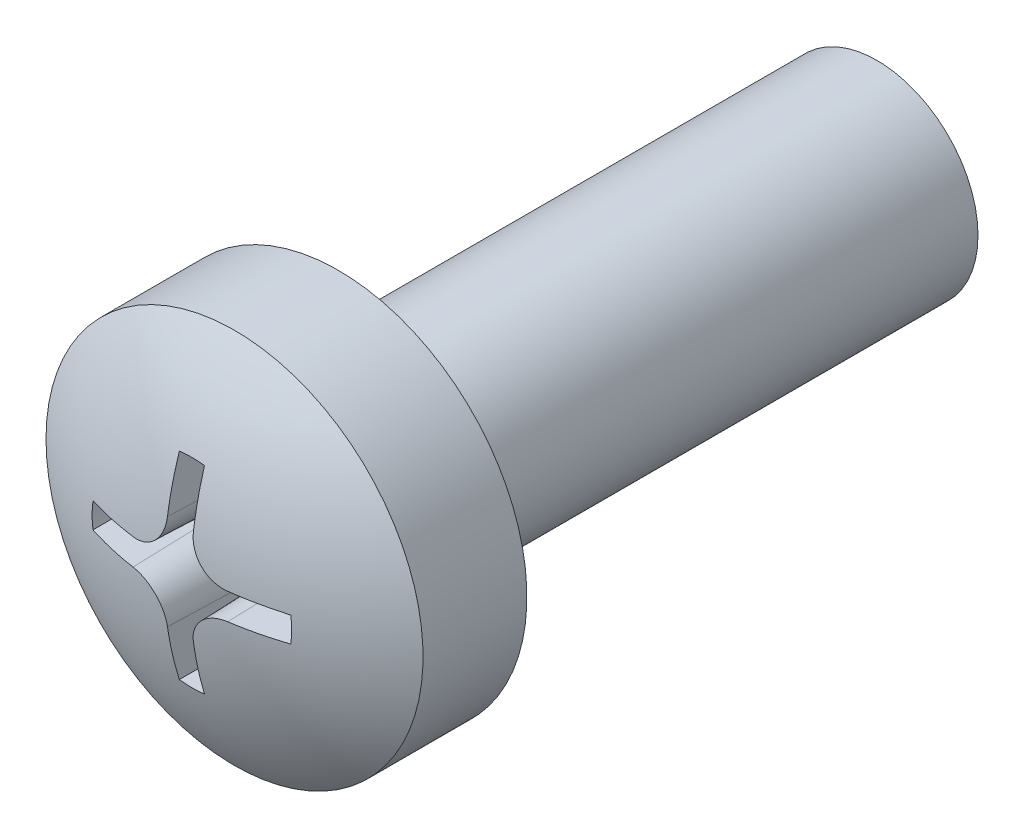
ISO-10303-21;
HEADER;
FILE_DESCRIPTION(('STEP AP214'),'2;1');
FILE_NAME('part.step','',(''),(''),'','','');
FILE_SCHEMA(('AUTOMOTIVE_DESIGN { 1 0 10303 214 1 1 1 1 }'));
ENDSEC;
DATA;
#1=APPLICATION_CONTEXT('core data for automotive mechanical design processes');
#2=APPLICATION_PROTOCOL_DEFINITION('international standard','automotive_design',2000,#1);
#3=PRODUCT_CONTEXT('',#1,'mechanical');
#4=PRODUCT('Part','Part','',(#3));
#5=PRODUCT_RELATED_PRODUCT_CATEGORY('part','',(#4));
#6=PRODUCT_DEFINITION_FORMATION('','',#4);
#7=PRODUCT_DEFINITION_CONTEXT('part definition',#1,'design');
#8=PRODUCT_DEFINITION('design','',#6,#7);
#9=PRODUCT_DEFINITION_SHAPE('','',#8);
#10=(LENGTH_UNIT() NAMED_UNIT(*) SI_UNIT(.MILLI.,.METRE.));
#11=(NAMED_UNIT(*) PLANE_ANGLE_UNIT() SI_UNIT($,.RADIAN.));
#12=(NAMED_UNIT(*) SI_UNIT($,.STERADIAN.) SOLID_ANGLE_UNIT());
#13=UNCERTAINTY_MEASURE_WITH_UNIT(LENGTH_MEASURE(1.E-05),#10,'distance_accuracy_value','');
#14=(GEOMETRIC_REPRESENTATION_CONTEXT(3) GLOBAL_UNCERTAINTY_ASSIGNED_CONTEXT((#13)) GLOBAL_UNIT_ASSIGNED_CONTEXT((#10,
#11,#12)) REPRESENTATION_CONTEXT('',''));
#15=CARTESIAN_POINT('',(0.,0.,0.));
#16=DIRECTION('',(0.,0.,1.));
#17=DIRECTION('',(1.,0.,0.));
#18=AXIS2_PLACEMENT_3D('',#15,#16,#17);
#19=CARTESIAN_POINT('',(0.,0.,8.));
#20=DIRECTION('',(0.,0.,-1.));
#21=DIRECTION('',(-1.,0.,0.));
#22=AXIS2_PLACEMENT_3D('',#19,#20,#21);
#23=CYLINDRICAL_SURFACE('',#22,1.5);
#24=CARTESIAN_POINT('',(0.,0.,8.));
#25=DIRECTION('',(0.,0.,1.));
#26=DIRECTION('',(1.,0.,0.));
#27=AXIS2_PLACEMENT_3D('',#24,#25,#26);
#28=CIRCLE('',#27,1.5);
#29=CARTESIAN_POINT('',(1.5,0.,8.));
#30=VERTEX_POINT('',#29);
#31=EDGE_CURVE('E206',#30,#30,#28,.T.);
#32=ORIENTED_EDGE('',*,*,#31,.F.);
#33=EDGE_LOOP('',(#32));
#34=FACE_BOUND('',#33,.T.);
#35=CARTESIAN_POINT('',(0.,0.,0.));
#36=DIRECTION('',(0.,0.,1.));
#37=DIRECTION('',(1.,0.,0.));
#38=AXIS2_PLACEMENT_3D('',#35,#36,#37);
#39=CIRCLE('',#38,1.5);
#40=CARTESIAN_POINT('',(1.5,0.,0.));
#41=VERTEX_POINT('',#40);
#42=EDGE_CURVE('E205',#41,#41,#39,.T.);
#43=ORIENTED_EDGE('',*,*,#42,.T.);
#44=EDGE_LOOP('',(#43));
#45=FACE_BOUND('',#44,.T.);
#46=ADVANCED_FACE('F34',(#34,#45),#23,.T.);
#47=CARTESIAN_POINT('',(0.,0.,0.));
#48=DIRECTION('',(0.,0.,1.));
#49=DIRECTION('',(1.,0.,0.));
#50=AXIS2_PLACEMENT_3D('',#47,#48,#49);
#51=PLANE('',#50);
#52=ORIENTED_EDGE('',*,*,#42,.F.);
#53=EDGE_LOOP('',(#52));
#54=FACE_BOUND('',#53,.T.);
#55=ADVANCED_FACE('F295',(#54),#51,.F.);
#56=CARTESIAN_POINT('',(0.,0.,8.));
#57=DIRECTION('',(0.,0.,-1.));
#58=DIRECTION('',(-1.,0.,0.));
#59=AXIS2_PLACEMENT_3D('',#56,#57,#58);
#60=PLANE('',#59);
#61=CARTESIAN_POINT('',(0.,0.,8.));
#62=DIRECTION('',(0.,0.,-1.));
#63=DIRECTION('',(-1.,0.,0.));
#64=AXIS2_PLACEMENT_3D('',#61,#62,#63);
#65=CIRCLE('',#64,2.79999990016222);
#66=CARTESIAN_POINT('',(-2.79999990016222,0.,8.));
#67=VERTEX_POINT('',#66);
#68=EDGE_CURVE('E202',#67,#67,#65,.T.);
#69=ORIENTED_EDGE('',*,*,#68,.T.);
#70=EDGE_LOOP('',(#69));
#71=FACE_BOUND('',#70,.T.);
#72=ORIENTED_EDGE('',*,*,#31,.T.);
#73=EDGE_LOOP('',(#72));
#74=FACE_BOUND('',#73,.T.);
#75=ADVANCED_FACE('F300',(#71,#74),#60,.T.);
#76=CARTESIAN_POINT('',(0.,0.,-0.393620134621003));
#77=DIRECTION('',(0.,0.,-1.));
#78=DIRECTION('',(-1.,0.,0.));
#79=AXIS2_PLACEMENT_3D('',#76,#77,#78);
#80=CYLINDRICAL_SURFACE('',#79,2.79999990016222);
#81=CARTESIAN_POINT('',(0.,0.,9.54246307978926));
#82=DIRECTION('',(0.,0.,-1.));
#83=DIRECTION('',(-1.,0.,0.));
#84=AXIS2_PLACEMENT_3D('',#81,#82,#83);
#85=CIRCLE('',#84,2.79999990016222);
#86=CARTESIAN_POINT('',(-2.79999990016222,0.,9.54246307978926));
#87=VERTEX_POINT('',#86);
#88=EDGE_CURVE('E150',#87,#87,#85,.T.);
#89=ORIENTED_EDGE('',*,*,#88,.T.);
#90=EDGE_LOOP('',(#89));
#91=FACE_BOUND('',#90,.T.);
#92=ORIENTED_EDGE('',*,*,#68,.F.);
#93=EDGE_LOOP('',(#92));
#94=FACE_BOUND('',#93,.T.);
#95=ADVANCED_FACE('F307',(#91,#94),#80,.T.);
#96=CARTESIAN_POINT('',(0.,0.,5.40000011175871));
#97=DIRECTION('',(0.,0.,-1.));
#98=DIRECTION('',(1.,0.,0.));
#99=AXIS2_PLACEMENT_3D('',#96,#97,#98);
#100=SPHERICAL_SURFACE('',#99,4.99999988824129);
#101=CARTESIAN_POINT('',(0.,0.,10.1754183821502));
#102=DIRECTION('',(0.,0.,-1.));
#103=DIRECTION('',(-1.,0.,0.));
#104=AXIS2_PLACEMENT_3D('',#101,#102,#103);
#105=CIRCLE('',#104,1.4816812157899);
#106=CARTESIAN_POINT('',(0.18668120666759,1.46987392394782,10.1754183821501));
#107=VERTEX_POINT('',#106);
#108=CARTESIAN_POINT('',(-0.186681206667593,1.46987392394782,10.1754183821501));
#109=VERTEX_POINT('',#108);
#110=EDGE_CURVE('E11',#107,#109,#105,.F.);
#111=ORIENTED_EDGE('',*,*,#110,.F.);
#112=CARTESIAN_POINT('',(0.0198956640512633,0.,5.39930533986049));
#113=DIRECTION('',(0.999390827019096,0.,-0.034899496702501));
#114=DIRECTION('',(-0.034899496702501,0.,-0.999390827019096));
#115=AXIS2_PLACEMENT_3D('',#112,#113,#114);
#116=CIRCLE('',#115,4.99996025606773);
#117=CARTESIAN_POINT('',(0.192632610704328,0.708178557647151,10.3458442955351));
#118=VERTEX_POINT('',#117);
#119=EDGE_CURVE('E41',#107,#118,#116,.T.);
#120=ORIENTED_EDGE('',*,*,#119,.T.);
#121=CARTESIAN_POINT('',(0.192631650862954,0.708378557647151,10.345815691475));
#122=CARTESIAN_POINT('',(0.192737639690806,0.679822741796073,10.3499041439734));
#123=CARTESIAN_POINT('',(0.195268867839181,0.651227392830896,10.3536463362414));
#124=CARTESIAN_POINT('',(0.205046889209158,0.59476703827459,10.3603460551712));
#125=CARTESIAN_POINT('',(0.212292618678018,0.566901869404939,10.3633037586285));
#126=CARTESIAN_POINT('',(0.231373694375068,0.51267267841366,10.3683466063254));
#127=CARTESIAN_POINT('',(0.24321326807329,0.486310064716558,10.3704309431667));
#128=CARTESIAN_POINT('',(0.271156607880554,0.435900324544809,10.3736603491012));
#129=CARTESIAN_POINT('',(0.287258672100205,0.411852279143786,10.3748057923215));
#130=CARTESIAN_POINT('',(0.323072075489885,0.367028886470806,10.3761158025717));
#131=CARTESIAN_POINT('',(0.342740648168188,0.346219679514825,10.3762912893596));
#132=CARTESIAN_POINT('',(0.385246757538768,0.30814670944778,10.3756853456951));
#133=CARTESIAN_POINT('',(0.408084792807392,0.290883505206881,10.3749037645383));
#134=CARTESIAN_POINT('',(0.456147210008961,0.260464262414973,10.3724133951705));
#135=CARTESIAN_POINT('',(0.481359759209805,0.247289131136679,10.3707090224733));
#136=CARTESIAN_POINT('',(0.533541444049374,0.225283958921734,10.3664258870809));
#137=CARTESIAN_POINT('',(0.560509920861877,0.216452298826715,10.3638474508254));
#138=CARTESIAN_POINT('',(0.606876295057338,0.205379627868596,10.3588207651558));
#139=CARTESIAN_POINT('',(0.626020977094074,0.201943221890059,10.3565812960749));
#140=CARTESIAN_POINT('',(0.66450204404321,0.197253494550336,10.3517582366185));
#141=CARTESIAN_POINT('',(0.683838077649067,0.195996727127303,10.349175196413));
#142=CARTESIAN_POINT('',(0.703167546290468,0.195835015722445,10.3464334662955));
#143=B_SPLINE_CURVE_WITH_KNOTS('',3,(#121,#122,#123,#124,#125,#126,#127,#128,#129,#130,#131,
#132,#133,#134,#135,#136,#137,#138,#139,#140,#141,#142),.UNSPECIFIED.,.F.,.F.,(4,2,2,2,2,2,2,2,
2,2,4),(0.,0.0864417829586744,0.172864068455127,0.259366073122684,0.345833591994609,
0.431325646912079,0.516831165542016,0.601931114274005,0.686999315371811,0.745618262708562,
0.804144447281415),.UNSPECIFIED.);
#144=CARTESIAN_POINT('',(0.702917362553185,0.19583721033533,10.3464689381926));
#145=VERTEX_POINT('',#144);
#146=EDGE_CURVE('E277',#118,#145,#143,.T.);
#147=ORIENTED_EDGE('',*,*,#146,.T.);
#148=CARTESIAN_POINT('',(0.00010539015335094,0.0259265633149154,5.39909472873738));
#149=DIRECTION('',(0.00406243901494415,0.999382570249833,-0.034899496702501));
#150=DIRECTION('',(0.,0.0348997846864301,0.999390816962434));
#151=AXIS2_PLACEMENT_3D('',#148,#149,#150);
#152=CIRCLE('',#151,4.99993258603575);
#153=CARTESIAN_POINT('',(1.46986565043204,0.186746338396853,10.1754183821502));
#154=VERTEX_POINT('',#153);
#155=EDGE_CURVE('E275',#154,#145,#152,.F.);
#156=ORIENTED_EDGE('',*,*,#155,.F.);
#157=CARTESIAN_POINT('',(0.,0.,10.1754183821502));
#158=DIRECTION('',(0.,0.,-1.));
#159=DIRECTION('',(-1.,0.,0.));
#160=AXIS2_PLACEMENT_3D('',#157,#158,#159);
#161=CIRCLE('',#160,1.4816812157899);
#162=CARTESIAN_POINT('',(1.46986565043204,-0.186746338396852,10.1754183821501));
#163=VERTEX_POINT('',#162);
#164=EDGE_CURVE('E273',#163,#154,#161,.F.);
#165=ORIENTED_EDGE('',*,*,#164,.F.);
#166=CARTESIAN_POINT('',(0.000105390153350971,-0.0259265633149169,5.39909472873738));
#167=DIRECTION('',(0.00406243901494512,-0.999382570249833,-0.034899496702501));
#168=DIRECTION('',(0.,0.0348997846864301,-0.999390816962434));
#169=AXIS2_PLACEMENT_3D('',#166,#167,#168);
#170=CIRCLE('',#169,4.99993258603575);
#171=CARTESIAN_POINT('',(0.702917362553185,-0.195837210335331,10.3464689381926));
#172=VERTEX_POINT('',#171);
#173=EDGE_CURVE('E270',#163,#172,#170,.T.);
#174=ORIENTED_EDGE('',*,*,#173,.T.);
#175=CARTESIAN_POINT('',(0.192631650862954,-0.708378557647152,10.345815691475));
#176=CARTESIAN_POINT('',(0.192737639690806,-0.679822741796074,10.3499041439734));
#177=CARTESIAN_POINT('',(0.195268867839181,-0.651227392830896,10.3536463362414));
#178=CARTESIAN_POINT('',(0.205046889209158,-0.59476703827459,10.3603460551712));
#179=CARTESIAN_POINT('',(0.212292618678018,-0.56690186940494,10.3633037586285));
#180=CARTESIAN_POINT('',(0.231373694375068,-0.512672678413661,10.3683466063254));
#181=CARTESIAN_POINT('',(0.24321326807329,-0.486310064716559,10.3704309431667));
#182=CARTESIAN_POINT('',(0.271156607880554,-0.435900324544809,10.3736603491012));
#183=CARTESIAN_POINT('',(0.287258672100205,-0.411852279143786,10.3748057923215));
#184=CARTESIAN_POINT('',(0.323072075489885,-0.367028886470807,10.3761158025717));
#185=CARTESIAN_POINT('',(0.342740648168188,-0.346219679514826,10.3762912893596));
#186=CARTESIAN_POINT('',(0.385246757538768,-0.308146709447781,10.3756853456951));
#187=CARTESIAN_POINT('',(0.408084792807392,-0.290883505206882,10.3749037645383));
#188=CARTESIAN_POINT('',(0.456147210008961,-0.260464262414974,10.3724133951705));
#189=CARTESIAN_POINT('',(0.481359759209805,-0.247289131136679,10.3707090224733));
#190=CARTESIAN_POINT('',(0.533541444049374,-0.225283958921735,10.3664258870809));
#191=CARTESIAN_POINT('',(0.560509920861878,-0.216452298826716,10.3638474508254));
#192=CARTESIAN_POINT('',(0.606876295057338,-0.205379627868597,10.3588207651558));
#193=CARTESIAN_POINT('',(0.626020977094074,-0.201943221890059,10.3565812960749));
#194=CARTESIAN_POINT('',(0.66450204404321,-0.197253494550336,10.3517582366185));
#195=CARTESIAN_POINT('',(0.683838077649067,-0.195996727127304,10.349175196413));
#196=CARTESIAN_POINT('',(0.703167546290467,-0.195835015722445,10.3464334662955));
#197=B_SPLINE_CURVE_WITH_KNOTS('',3,(#175,#176,#177,#178,#179,#180,#181,#182,#183,#184,#185,
#186,#187,#188,#189,#190,#191,#192,#193,#194,#195,#196),.UNSPECIFIED.,.F.,.F.,(4,2,2,2,2,2,2,2,
2,2,4),(0.,0.0864417829586745,0.172864068455127,0.259366073122684,0.345833591994609,
0.431325646912079,0.516831165542017,0.601931114274005,0.686999315371811,0.745618262708562,
0.804144447281414),.UNSPECIFIED.);
#198=CARTESIAN_POINT('',(0.192632610704328,-0.708178557647152,10.3458442955351));
#199=VERTEX_POINT('',#198);
#200=EDGE_CURVE('E264',#199,#172,#197,.T.);
#201=ORIENTED_EDGE('',*,*,#200,.F.);
#202=CARTESIAN_POINT('',(0.0198956640512633,0.,5.39930533986049));
#203=DIRECTION('',(0.999390827019096,0.,-0.034899496702501));
#204=DIRECTION('',(-0.034899496702501,0.,-0.999390827019096));
#205=AXIS2_PLACEMENT_3D('',#202,#203,#204);
#206=CIRCLE('',#205,4.99996025606773);
#207=CARTESIAN_POINT('',(0.186681206667591,-1.46987392394782,10.1754183821502));
#208=VERTEX_POINT('',#207);
#209=EDGE_CURVE('E262',#208,#199,#206,.F.);
#210=ORIENTED_EDGE('',*,*,#209,.F.);
#211=CARTESIAN_POINT('',(0.,0.,10.1754183821502));
#212=DIRECTION('',(0.,0.,-1.));
#213=DIRECTION('',(-1.,0.,0.));
#214=AXIS2_PLACEMENT_3D('',#211,#212,#213);
#215=CIRCLE('',#214,1.4816812157899);
#216=CARTESIAN_POINT('',(-0.186681206667593,-1.46987392394782,10.1754183821501));
#217=VERTEX_POINT('',#216);
#218=EDGE_CURVE('E259',#208,#217,#215,.T.);
#219=ORIENTED_EDGE('',*,*,#218,.T.);
#220=CARTESIAN_POINT('',(-0.0198956640512654,0.,5.39930533986049));
#221=DIRECTION('',(-0.999390827019096,0.,-0.034899496702501));
#222=DIRECTION('',(-0.034899496702501,0.,0.999390827019096));
#223=AXIS2_PLACEMENT_3D('',#220,#221,#222);
#224=CIRCLE('',#223,4.99996025606773);
#225=CARTESIAN_POINT('',(-0.19263261070433,-0.708178557647151,10.3458442955351));
#226=VERTEX_POINT('',#225);
#227=EDGE_CURVE('E255',#217,#226,#224,.T.);
#228=ORIENTED_EDGE('',*,*,#227,.T.);
#229=CARTESIAN_POINT('',(-0.70316754629047,-0.195835015722445,10.3464334662955));
#230=CARTESIAN_POINT('',(-0.674619447950853,-0.196052963217916,10.3504857241648));
#231=CARTESIAN_POINT('',(-0.64604143463723,-0.198695168407334,10.3541890416191));
#232=CARTESIAN_POINT('',(-0.589634494727846,-0.208689654905481,10.3608068014756));
#233=CARTESIAN_POINT('',(-0.561805393198953,-0.216040826152062,10.3637214295682));
#234=CARTESIAN_POINT('',(-0.50766612082123,-0.235323893103952,10.3686750861046));
#235=CARTESIAN_POINT('',(-0.481357369172765,-0.247259991703852,10.370713307523));
#236=CARTESIAN_POINT('',(-0.431071022991569,-0.275383990623327,10.3738489099634));
#237=CARTESIAN_POINT('',(-0.407092510169895,-0.291570206692358,10.3749466629444));
#238=CARTESIAN_POINT('',(-0.362416703115867,-0.327538701485094,10.3761618083202));
#239=CARTESIAN_POINT('',(-0.34168588735275,-0.347278991317759,10.376289966384));
#240=CARTESIAN_POINT('',(-0.303780328011577,-0.389912448398922,10.375590364716));
#241=CARTESIAN_POINT('',(-0.286606147147997,-0.412806113607388,10.3747624538554));
#242=CARTESIAN_POINT('',(-0.25636685808405,-0.460969475916929,10.3721816258056));
#243=CARTESIAN_POINT('',(-0.243283863198687,-0.486228184526672,10.3704328274806));
#244=CARTESIAN_POINT('',(-0.22146899790456,-0.538485231439468,10.366063898297));
#245=CARTESIAN_POINT('',(-0.212735526227358,-0.565482925398504,10.3634440886927));
#246=CARTESIAN_POINT('',(-0.201823996880683,-0.61191361527353,10.3583478129874));
#247=CARTESIAN_POINT('',(-0.198453223120025,-0.631098599357625,10.3560784464194));
#248=CARTESIAN_POINT('',(-0.193901764340931,-0.669652448873598,10.3511968730386));
#249=CARTESIAN_POINT('',(-0.192717622166763,-0.689020975292663,10.3485852144187));
#250=CARTESIAN_POINT('',(-0.192631650862956,-0.708378557647151,10.345815691475));
#251=B_SPLINE_CURVE_WITH_KNOTS('',3,(#229,#230,#231,#232,#233,#234,#235,#236,#237,#238,#239,
#240,#241,#242,#243,#244,#245,#246,#247,#248,#249,#250),.UNSPECIFIED.,.F.,.F.,(4,2,2,2,2,2,2,2,
2,2,4),(0.,0.086405343611419,0.172790326060609,0.259254685287909,0.34568483171133,
0.431153892876567,0.51663646625136,0.601739908197796,0.686811996276178,0.745524819849982,
0.804144736260156),.UNSPECIFIED.);
#252=CARTESIAN_POINT('',(-0.702917362553187,-0.195837210335331,10.3464689381926));
#253=VERTEX_POINT('',#252);
#254=EDGE_CURVE('E248',#253,#226,#251,.T.);
#255=ORIENTED_EDGE('',*,*,#254,.F.);
#256=CARTESIAN_POINT('',(-0.000105390153349066,-0.0259265633149168,5.39909472873738));
#257=DIRECTION('',(-0.0040624390149453,-0.999382570249833,-0.034899496702501));
#258=DIRECTION('',(0.,0.0348997846864301,-0.999390816962434));
#259=AXIS2_PLACEMENT_3D('',#256,#257,#258);
#260=CIRCLE('',#259,4.99993258603575);
#261=CARTESIAN_POINT('',(-1.46986565043204,-0.186746338396853,10.1754183821502));
#262=VERTEX_POINT('',#261);
#263=EDGE_CURVE('E256',#262,#253,#260,.F.);
#264=ORIENTED_EDGE('',*,*,#263,.F.);
#265=CARTESIAN_POINT('',(0.,0.,10.1754183821502));
#266=DIRECTION('',(0.,0.,-1.));
#267=DIRECTION('',(-1.,0.,0.));
#268=AXIS2_PLACEMENT_3D('',#265,#266,#267);
#269=CIRCLE('',#268,1.4816812157899);
#270=CARTESIAN_POINT('',(-1.46986565043204,0.186746338396852,10.1754183821501));
#271=VERTEX_POINT('',#270);
#272=EDGE_CURVE('E594',#262,#271,#269,.T.);
#273=ORIENTED_EDGE('',*,*,#272,.T.);
#274=CARTESIAN_POINT('',(-0.000105390153349066,0.0259265633149168,5.39909472873738));
#275=DIRECTION('',(-0.00406243901494529,0.999382570249833,-0.034899496702501));
#276=DIRECTION('',(0.,0.0348997846864301,0.999390816962434));
#277=AXIS2_PLACEMENT_3D('',#274,#275,#276);
#278=CIRCLE('',#277,4.99993258603575);
#279=CARTESIAN_POINT('',(-0.702917362553187,0.195837210335331,10.3464689381926));
#280=VERTEX_POINT('',#279);
#281=EDGE_CURVE('E221',#271,#280,#278,.T.);
#282=ORIENTED_EDGE('',*,*,#281,.T.);
#283=CARTESIAN_POINT('',(-0.192631650862955,0.708378557647151,10.345815691475));
#284=CARTESIAN_POINT('',(-0.192737639690808,0.679822741796074,10.3499041439734));
#285=CARTESIAN_POINT('',(-0.195268867839183,0.651227392830896,10.3536463362414));
#286=CARTESIAN_POINT('',(-0.20504688920916,0.59476703827459,10.3603460551712));
#287=CARTESIAN_POINT('',(-0.21229261867802,0.566901869404939,10.3633037586285));
#288=CARTESIAN_POINT('',(-0.231373694375069,0.51267267841366,10.3683466063254));
#289=CARTESIAN_POINT('',(-0.243213268073292,0.486310064716559,10.3704309431667));
#290=CARTESIAN_POINT('',(-0.271156607880555,0.435900324544809,10.3736603491012));
#291=CARTESIAN_POINT('',(-0.287258672100206,0.411852279143786,10.3748057923215));
#292=CARTESIAN_POINT('',(-0.323072075489887,0.367028886470806,10.3761158025717));
#293=CARTESIAN_POINT('',(-0.34274064816819,0.346219679514826,10.3762912893596));
#294=CARTESIAN_POINT('',(-0.38524675753877,0.30814670944778,10.3756853456951));
#295=CARTESIAN_POINT('',(-0.408084792807394,0.290883505206882,10.3749037645383));
#296=CARTESIAN_POINT('',(-0.456147210008963,0.260464262414974,10.3724133951705));
#297=CARTESIAN_POINT('',(-0.481359759209807,0.247289131136679,10.3707090224733));
#298=CARTESIAN_POINT('',(-0.533541444049376,0.225283958921735,10.3664258870809));
#299=CARTESIAN_POINT('',(-0.560509920861879,0.216452298826716,10.3638474508254));
#300=CARTESIAN_POINT('',(-0.60687629505734,0.205379627868597,10.3588207651558));
#301=CARTESIAN_POINT('',(-0.626020977094076,0.201943221890059,10.3565812960749));
#302=CARTESIAN_POINT('',(-0.664502044043212,0.197253494550336,10.3517582366185));
#303=CARTESIAN_POINT('',(-0.683838077649068,0.195996727127304,10.349175196413));
#304=CARTESIAN_POINT('',(-0.703167546290469,0.195835015722445,10.3464334662955));
#305=B_SPLINE_CURVE_WITH_KNOTS('',3,(#283,#284,#285,#286,#287,#288,#289,#290,#291,#292,#293,
#294,#295,#296,#297,#298,#299,#300,#301,#302,#303,#304),.UNSPECIFIED.,.F.,.F.,(4,2,2,2,2,2,2,2,
2,2,4),(0.,0.0864417829586746,0.172864068455127,0.259366073122684,0.345833591994609,
0.431325646912079,0.516831165542016,0.601931114274005,0.686999315371811,0.745618262708561,
0.804144447281414),.UNSPECIFIED.);
#306=CARTESIAN_POINT('',(-0.19263261070433,0.708178557647151,10.3458442955351));
#307=VERTEX_POINT('',#306);
#308=EDGE_CURVE('E213',#307,#280,#305,.T.);
#309=ORIENTED_EDGE('',*,*,#308,.F.);
#310=CARTESIAN_POINT('',(-0.0198956640512644,0.,5.39930533986049));
#311=DIRECTION('',(-0.999390827019096,0.,-0.034899496702501));
#312=DIRECTION('',(-0.034899496702501,0.,0.999390827019096));
#313=AXIS2_PLACEMENT_3D('',#310,#311,#312);
#314=CIRCLE('',#313,4.99996025606773);
#315=EDGE_CURVE('E209',#109,#307,#314,.F.);
#316=ORIENTED_EDGE('',*,*,#315,.F.);
#317=EDGE_LOOP('',(#111,#120,#147,#156,#165,#174,#201,#210,#219,#228,#255,#264,#273,#282,#309,#316));
#318=FACE_BOUND('',#317,.T.);
#319=ORIENTED_EDGE('',*,*,#88,.F.);
#320=EDGE_LOOP('',(#319));
#321=FACE_BOUND('',#320,.T.);
#322=ADVANCED_FACE('F223',(#318,#321),#100,.T.);
#323=CARTESIAN_POINT('',(0.,0.,10.7000001));
#324=DIRECTION('',(0.,0.,1.));
#325=DIRECTION('',(1.,0.,0.));
#326=AXIS2_PLACEMENT_3D('',#323,#324,#325);
#327=CONICAL_SURFACE('',#326,1.50000001303852,0.0349065850398867);
#328=ORIENTED_EDGE('',*,*,#110,.T.);
#329=CARTESIAN_POINT('',(-0.142142619910814,1.43009594495933,8.90000013091991));
#330=CARTESIAN_POINT('',(-0.152618658076336,1.43957885994155,9.19999461322929));
#331=CARTESIAN_POINT('',(-0.163094792502732,1.4489727928664,9.49999185208944));
#332=CARTESIAN_POINT('',(-0.184047253837866,1.46758269456637,10.0999918417828));
#333=CARTESIAN_POINT('',(-0.194523580746602,1.47679866334215,10.399994592616));
#334=CARTESIAN_POINT('',(-0.205000003916213,1.48592565006124,10.7000001));
#335=B_SPLINE_CURVE_WITH_KNOTS('',3,(#329,#330,#331,#332,#333,#334),.UNSPECIFIED.,.F.,.F.,(4,2,
4),(0.,0.900981158642231,1.80196231389533),.UNSPECIFIED.);
#336=CARTESIAN_POINT('',(-0.142142619910814,1.43009594495933,8.90000013091991));
#337=VERTEX_POINT('',#336);
#338=EDGE_CURVE('E48',#337,#109,#335,.T.);
#339=ORIENTED_EDGE('',*,*,#338,.F.);
#340=CARTESIAN_POINT('',(0.,0.,8.90000013091991));
#341=DIRECTION('',(0.,0.,1.));
#342=DIRECTION('',(1.,0.,0.));
#343=AXIS2_PLACEMENT_3D('',#340,#341,#342);
#344=CIRCLE('',#343,1.43714262903312);
#345=CARTESIAN_POINT('',(0.142142619910811,1.43009594495933,8.90000013091991));
#346=VERTEX_POINT('',#345);
#347=EDGE_CURVE('E158',#346,#337,#344,.T.);
#348=ORIENTED_EDGE('',*,*,#347,.F.);
#349=CARTESIAN_POINT('',(0.142142619910811,1.43009594495933,8.90000013091991));
#350=CARTESIAN_POINT('',(0.152618658076333,1.43957885994155,9.19999461322929));
#351=CARTESIAN_POINT('',(0.16309479250273,1.4489727928664,9.49999185208944));
#352=CARTESIAN_POINT('',(0.184047253837863,1.46758269456637,10.0999918417828));
#353=CARTESIAN_POINT('',(0.1945235807466,1.47679866334215,10.399994592616));
#354=CARTESIAN_POINT('',(0.205000003916211,1.48592565006124,10.7000001));
#355=B_SPLINE_CURVE_WITH_KNOTS('',3,(#349,#350,#351,#352,#353,#354),.UNSPECIFIED.,.F.,.F.,(4,2,
4),(0.,0.900981158642231,1.80196231389533),.UNSPECIFIED.);
#356=EDGE_CURVE('E142',#346,#107,#355,.T.);
#357=ORIENTED_EDGE('',*,*,#356,.T.);
#358=EDGE_LOOP('',(#328,#339,#348,#357));
#359=FACE_BOUND('',#358,.T.);
#360=ADVANCED_FACE('F162',(#359),#327,.F.);
#361=CARTESIAN_POINT('',(0.205000003916211,1.48592565006124,10.7000001));
#362=DIRECTION('',(0.999390827019096,0.,-0.034899496702501));
#363=DIRECTION('',(-0.034899496702501,0.,-0.999390827019096));
#364=AXIS2_PLACEMENT_3D('',#361,#362,#363);
#365=PLANE('',#364);
#366=ORIENTED_EDGE('',*,*,#356,.F.);
#367=DIRECTION('',(0.,1.,0.));
#368=VECTOR('',#367,1.);
#369=CARTESIAN_POINT('',(0.142142619910812,0.,8.90000013091991));
#370=LINE('',#369,#368);
#371=CARTESIAN_POINT('',(0.142142619910811,0.708178557647151,8.90000013091991));
#372=VERTEX_POINT('',#371);
#373=EDGE_CURVE('E145',#346,#372,#370,.F.);
#374=ORIENTED_EDGE('',*,*,#373,.T.);
#375=DIRECTION('',(0.034899496702501,0.,0.999390827019096));
#376=VECTOR('',#375,1.);
#377=CARTESIAN_POINT('',(0.20500000391621,0.708178557647151,10.7000001));
#378=LINE('',#377,#376);
#379=EDGE_CURVE('E151',#372,#118,#378,.T.);
#380=ORIENTED_EDGE('',*,*,#379,.T.);
#381=ORIENTED_EDGE('',*,*,#119,.F.);
#382=EDGE_LOOP('',(#366,#374,#380,#381));
#383=FACE_BOUND('',#382,.T.);
#384=ADVANCED_FACE('F144',(#383),#365,.F.);
#385=CARTESIAN_POINT('',(0.705000003916211,0.708178557647151,10.7000001));
#386=DIRECTION('',(0.,0.,-1.));
#387=DIRECTION('',(1.,0.,0.));
#388=AXIS2_PLACEMENT_3D('',#385,#386,#387);
#389=CONICAL_SURFACE('',#388,0.5,0.0349065850398867);
#390=ORIENTED_EDGE('',*,*,#379,.F.);
#391=CARTESIAN_POINT('',(0.705000003916211,0.708178557647151,8.90000013091991));
#392=DIRECTION('',(0.,0.,1.));
#393=DIRECTION('',(1.,0.,0.));
#394=AXIS2_PLACEMENT_3D('',#391,#392,#393);
#395=CIRCLE('',#394,0.562857384005399);
#396=CARTESIAN_POINT('',(0.702712036351556,0.145325823858085,8.90000013091991));
#397=VERTEX_POINT('',#396);
#398=EDGE_CURVE('E160',#372,#397,#395,.T.);
#399=ORIENTED_EDGE('',*,*,#398,.T.);
#400=DIRECTION('',(0.000141863496415148,0.0348992083697649,0.999390827019096));
#401=VECTOR('',#400,1.);
#402=CARTESIAN_POINT('',(0.702967546290468,0.208182688548215,10.7000001));
#403=LINE('',#402,#401);
#404=EDGE_CURVE('E420',#397,#145,#403,.T.);
#405=ORIENTED_EDGE('',*,*,#404,.T.);
#406=ORIENTED_EDGE('',*,*,#146,.F.);
#407=EDGE_LOOP('',(#390,#399,#405,#406));
#408=FACE_BOUND('',#407,.T.);
#409=ADVANCED_FACE('F283',(#408),#389,.T.);
#410=CARTESIAN_POINT('',(1.48592565006123,0.205000003916213,10.7000001));
#411=DIRECTION('',(0.00406243901494415,0.999382570249833,-0.034899496702501));
#412=DIRECTION('',(0.,0.0348997846864301,0.999390816962434));
#413=AXIS2_PLACEMENT_3D('',#410,#411,#412);
#414=PLANE('',#413);
#415=ORIENTED_EDGE('',*,*,#155,.T.);
#416=ORIENTED_EDGE('',*,*,#404,.F.);
#417=DIRECTION('',(-0.99999173819787,0.00406491525148502,0.));
#418=VECTOR('',#417,1.);
#419=CARTESIAN_POINT('',(0.000602343564913371,0.148179863836023,8.90000013091991));
#420=LINE('',#419,#418);
#421=CARTESIAN_POINT('',(1.43007341244828,0.142369137079488,8.90000013091991));
#422=VERTEX_POINT('',#421);
#423=EDGE_CURVE('E171',#422,#397,#420,.T.);
#424=ORIENTED_EDGE('',*,*,#423,.F.);
#425=CARTESIAN_POINT('',(1.43007341244828,0.142369137079488,8.90000013091991));
#426=CARTESIAN_POINT('',(1.43955869120937,0.152806706922151,9.19999467904414));
#427=CARTESIAN_POINT('',(1.44895568373278,0.163244730756208,9.49999195080733));
#428=CARTESIAN_POINT('',(1.46757309626977,0.184121686368453,10.0999919405007));
#429=CARTESIAN_POINT('',(1.47679351628402,0.194560618146638,10.3999946584309));
#430=CARTESIAN_POINT('',(1.48592565006123,0.205000003916213,10.7000001));
#431=B_SPLINE_CURVE_WITH_KNOTS('',3,(#425,#426,#427,#428,#429,#430),.UNSPECIFIED.,.F.,.F.,(4,2,
4),(0.,0.900977563471273,1.80195512360615),.UNSPECIFIED.);
#432=EDGE_CURVE('E414',#422,#154,#431,.T.);
#433=ORIENTED_EDGE('',*,*,#432,.T.);
#434=EDGE_LOOP('',(#415,#416,#424,#433));
#435=FACE_BOUND('',#434,.T.);
#436=ADVANCED_FACE('F235',(#435),#414,.F.);
#437=CARTESIAN_POINT('',(0.,0.,10.7000001));
#438=DIRECTION('',(0.,0.,1.));
#439=DIRECTION('',(1.,0.,0.));
#440=AXIS2_PLACEMENT_3D('',#437,#438,#439);
#441=CONICAL_SURFACE('',#440,1.50000001303852,0.0349065850398867);
#442=ORIENTED_EDGE('',*,*,#164,.T.);
#443=ORIENTED_EDGE('',*,*,#432,.F.);
#444=CARTESIAN_POINT('',(0.,0.,8.90000013091991));
#445=DIRECTION('',(0.,0.,1.));
#446=DIRECTION('',(1.,0.,0.));
#447=AXIS2_PLACEMENT_3D('',#444,#445,#446);
#448=CIRCLE('',#447,1.43714262903312);
#449=CARTESIAN_POINT('',(1.43007341244828,-0.142369137079488,8.90000013091991));
#450=VERTEX_POINT('',#449);
#451=EDGE_CURVE('E173',#450,#422,#448,.T.);
#452=ORIENTED_EDGE('',*,*,#451,.F.);
#453=CARTESIAN_POINT('',(1.43007341244828,-0.142369137079488,8.90000013091991));
#454=CARTESIAN_POINT('',(1.43955869120937,-0.152806706922151,9.19999467904414));
#455=CARTESIAN_POINT('',(1.44895568373278,-0.163244730756208,9.49999195080733));
#456=CARTESIAN_POINT('',(1.46757309626977,-0.184121686368453,10.0999919405007));
#457=CARTESIAN_POINT('',(1.47679351628402,-0.194560618146638,10.3999946584309));
#458=CARTESIAN_POINT('',(1.48592565006123,-0.205000003916213,10.7000001));
#459=B_SPLINE_CURVE_WITH_KNOTS('',3,(#453,#454,#455,#456,#457,#458),.UNSPECIFIED.,.F.,.F.,(4,2,
4),(0.,0.900977563471273,1.80195512360615),.UNSPECIFIED.);
#460=EDGE_CURVE('E408',#450,#163,#459,.T.);
#461=ORIENTED_EDGE('',*,*,#460,.T.);
#462=EDGE_LOOP('',(#442,#443,#452,#461));
#463=FACE_BOUND('',#462,.T.);
#464=ADVANCED_FACE('F291',(#463),#441,.F.);
#465=CARTESIAN_POINT('',(1.48592565006123,-0.205000003916213,10.7000001));
#466=DIRECTION('',(0.00406243901494512,-0.999382570249833,-0.034899496702501));
#467=DIRECTION('',(0.,0.0348997846864301,-0.999390816962434));
#468=AXIS2_PLACEMENT_3D('',#465,#466,#467);
#469=PLANE('',#468);
#470=ORIENTED_EDGE('',*,*,#460,.F.);
#471=DIRECTION('',(0.99999173819787,0.00406491525148599,0.));
#472=VECTOR('',#471,1.);
#473=CARTESIAN_POINT('',(0.00060234356491352,-0.148179863836024,8.90000013091991));
#474=LINE('',#473,#472);
#475=CARTESIAN_POINT('',(0.702712036351556,-0.145325823858086,8.90000013091991));
#476=VERTEX_POINT('',#475);
#477=EDGE_CURVE('E176',#450,#476,#474,.F.);
#478=ORIENTED_EDGE('',*,*,#477,.T.);
#479=DIRECTION('',(0.000141863496415188,-0.0348992083697649,0.999390827019096));
#480=VECTOR('',#479,1.);
#481=CARTESIAN_POINT('',(0.702967546290468,-0.208182688548216,10.7000001));
#482=LINE('',#481,#480);
#483=EDGE_CURVE('E430',#476,#172,#482,.T.);
#484=ORIENTED_EDGE('',*,*,#483,.T.);
#485=ORIENTED_EDGE('',*,*,#173,.F.);
#486=EDGE_LOOP('',(#470,#478,#484,#485));
#487=FACE_BOUND('',#486,.T.);
#488=ADVANCED_FACE('F403',(#487),#469,.F.);
#489=CARTESIAN_POINT('',(0.705000003916211,-0.708178557647152,10.7000001));
#490=DIRECTION('',(0.,0.,-1.));
#491=DIRECTION('',(-1.,0.,0.));
#492=AXIS2_PLACEMENT_3D('',#489,#490,#491);
#493=CONICAL_SURFACE('',#492,0.5,0.0349065850398867);
#494=ORIENTED_EDGE('',*,*,#200,.T.);
#495=ORIENTED_EDGE('',*,*,#483,.F.);
#496=CARTESIAN_POINT('',(0.705000003916211,-0.708178557647152,8.90000013091991));
#497=DIRECTION('',(0.,0.,1.));
#498=DIRECTION('',(1.,0.,0.));
#499=AXIS2_PLACEMENT_3D('',#496,#497,#498);
#500=CIRCLE('',#499,0.562857384005399);
#501=CARTESIAN_POINT('',(0.142142619910812,-0.708178557647152,8.90000013091991));
#502=VERTEX_POINT('',#501);
#503=EDGE_CURVE('E178',#502,#476,#500,.F.);
#504=ORIENTED_EDGE('',*,*,#503,.F.);
#505=DIRECTION('',(0.034899496702501,0.,0.999390827019096));
#506=VECTOR('',#505,1.);
#507=CARTESIAN_POINT('',(0.205000003916211,-0.708178557647152,10.7000001));
#508=LINE('',#507,#506);
#509=EDGE_CURVE('E394',#502,#199,#508,.T.);
#510=ORIENTED_EDGE('',*,*,#509,.T.);
#511=EDGE_LOOP('',(#494,#495,#504,#510));
#512=FACE_BOUND('',#511,.T.);
#513=ADVANCED_FACE('F245',(#512),#493,.T.);
#514=CARTESIAN_POINT('',(0.205000003916211,-1.48592565006124,10.7000001));
#515=DIRECTION('',(0.999390827019096,0.,-0.034899496702501));
#516=DIRECTION('',(-0.034899496702501,0.,-0.999390827019096));
#517=AXIS2_PLACEMENT_3D('',#514,#515,#516);
#518=PLANE('',#517);
#519=ORIENTED_EDGE('',*,*,#209,.T.);
#520=ORIENTED_EDGE('',*,*,#509,.F.);
#521=DIRECTION('',(0.,1.,0.));
#522=VECTOR('',#521,1.);
#523=CARTESIAN_POINT('',(0.142142619910812,0.,8.90000013091991));
#524=LINE('',#523,#522);
#525=CARTESIAN_POINT('',(0.142142619910811,-1.43009594495933,8.90000013091991));
#526=VERTEX_POINT('',#525);
#527=EDGE_CURVE('E181',#526,#502,#524,.T.);
#528=ORIENTED_EDGE('',*,*,#527,.F.);
#529=CARTESIAN_POINT('',(0.142142619910811,-1.43009594495933,8.90000013091991));
#530=CARTESIAN_POINT('',(0.152618658076333,-1.43957885994155,9.19999461322929));
#531=CARTESIAN_POINT('',(0.16309479250273,-1.4489727928664,9.49999185208944));
#532=CARTESIAN_POINT('',(0.184047253837863,-1.46758269456637,10.0999918417828));
#533=CARTESIAN_POINT('',(0.1945235807466,-1.47679866334215,10.399994592616));
#534=CARTESIAN_POINT('',(0.205000003916211,-1.48592565006124,10.7000001));
#535=B_SPLINE_CURVE_WITH_KNOTS('',3,(#529,#530,#531,#532,#533,#534),.UNSPECIFIED.,.F.,.F.,(4,2,
4),(0.,0.900981158642231,1.80196231389533),.UNSPECIFIED.);
#536=EDGE_CURVE('E386',#526,#208,#535,.T.);
#537=ORIENTED_EDGE('',*,*,#536,.T.);
#538=EDGE_LOOP('',(#519,#520,#528,#537));
#539=FACE_BOUND('',#538,.T.);
#540=ADVANCED_FACE('F396',(#539),#518,.F.);
#541=CARTESIAN_POINT('',(0.,0.,10.7000001));
#542=DIRECTION('',(0.,0.,1.));
#543=DIRECTION('',(-1.,0.,0.));
#544=AXIS2_PLACEMENT_3D('',#541,#542,#543);
#545=CONICAL_SURFACE('',#544,1.50000001303852,0.0349065850398867);
#546=ORIENTED_EDGE('',*,*,#536,.F.);
#547=CARTESIAN_POINT('',(0.,0.,8.90000013091991));
#548=DIRECTION('',(0.,0.,1.));
#549=DIRECTION('',(1.,0.,0.));
#550=AXIS2_PLACEMENT_3D('',#547,#548,#549);
#551=CIRCLE('',#550,1.43714262903312);
#552=CARTESIAN_POINT('',(-0.142142619910814,-1.43009594495933,8.90000013091991));
#553=VERTEX_POINT('',#552);
#554=EDGE_CURVE('E184',#526,#553,#551,.F.);
#555=ORIENTED_EDGE('',*,*,#554,.T.);
#556=CARTESIAN_POINT('',(-0.142142619910814,-1.43009594495933,8.90000013091991));
#557=CARTESIAN_POINT('',(-0.152618658076336,-1.43957885994155,9.19999461322929));
#558=CARTESIAN_POINT('',(-0.163094792502732,-1.4489727928664,9.49999185208944));
#559=CARTESIAN_POINT('',(-0.184047253837866,-1.46758269456637,10.0999918417828));
#560=CARTESIAN_POINT('',(-0.194523580746602,-1.47679866334215,10.399994592616));
#561=CARTESIAN_POINT('',(-0.205000003916213,-1.48592565006124,10.7000001));
#562=B_SPLINE_CURVE_WITH_KNOTS('',3,(#556,#557,#558,#559,#560,#561),.UNSPECIFIED.,.F.,.F.,(4,2,
4),(0.,0.900981158642231,1.80196231389533),.UNSPECIFIED.);
#563=EDGE_CURVE('E378',#553,#217,#562,.T.);
#564=ORIENTED_EDGE('',*,*,#563,.T.);
#565=ORIENTED_EDGE('',*,*,#218,.F.);
#566=EDGE_LOOP('',(#546,#555,#564,#565));
#567=FACE_BOUND('',#566,.T.);
#568=ADVANCED_FACE('F373',(#567),#545,.F.);
#569=CARTESIAN_POINT('',(-0.205000003916213,-1.48592565006124,10.7000001));
#570=DIRECTION('',(-0.999390827019096,0.,-0.034899496702501));
#571=DIRECTION('',(-0.034899496702501,0.,0.999390827019096));
#572=AXIS2_PLACEMENT_3D('',#569,#570,#571);
#573=PLANE('',#572);
#574=ORIENTED_EDGE('',*,*,#563,.F.);
#575=DIRECTION('',(0.,-1.,0.));
#576=VECTOR('',#575,1.);
#577=CARTESIAN_POINT('',(-0.142142619910814,0.,8.90000013091991));
#578=LINE('',#577,#576);
#579=CARTESIAN_POINT('',(-0.142142619910814,-0.708178557647151,8.90000013091991));
#580=VERTEX_POINT('',#579);
#581=EDGE_CURVE('E186',#553,#580,#578,.F.);
#582=ORIENTED_EDGE('',*,*,#581,.T.);
#583=DIRECTION('',(-0.034899496702501,0.,0.999390827019096));
#584=VECTOR('',#583,1.);
#585=CARTESIAN_POINT('',(-0.205000003916213,-0.708178557647151,10.7000001));
#586=LINE('',#585,#584);
#587=EDGE_CURVE('E387',#580,#226,#586,.T.);
#588=ORIENTED_EDGE('',*,*,#587,.T.);
#589=ORIENTED_EDGE('',*,*,#227,.F.);
#590=EDGE_LOOP('',(#574,#582,#588,#589));
#591=FACE_BOUND('',#590,.T.);
#592=ADVANCED_FACE('F243',(#591),#573,.F.);
#593=CARTESIAN_POINT('',(-0.705000003916213,-0.708178557647151,10.7000001));
#594=DIRECTION('',(0.,0.,-1.));
#595=DIRECTION('',(-1.,0.,0.));
#596=AXIS2_PLACEMENT_3D('',#593,#594,#595);
#597=CONICAL_SURFACE('',#596,0.5,0.0349065850398867);
#598=ORIENTED_EDGE('',*,*,#254,.T.);
#599=ORIENTED_EDGE('',*,*,#587,.F.);
#600=CARTESIAN_POINT('',(-0.705000003916213,-0.708178557647151,8.90000013091991));
#601=DIRECTION('',(0.,0.,1.));
#602=DIRECTION('',(1.,0.,0.));
#603=AXIS2_PLACEMENT_3D('',#600,#601,#602);
#604=CIRCLE('',#603,0.562857384005399);
#605=CARTESIAN_POINT('',(-0.702712036351558,-0.145325823858086,8.90000013091991));
#606=VERTEX_POINT('',#605);
#607=EDGE_CURVE('E188',#606,#580,#604,.F.);
#608=ORIENTED_EDGE('',*,*,#607,.F.);
#609=DIRECTION('',(-0.000141863496415188,-0.0348992083697649,0.999390827019096));
#610=VECTOR('',#609,1.);
#611=CARTESIAN_POINT('',(-0.70296754629047,-0.208182688548216,10.7000001));
#612=LINE('',#611,#610);
#613=EDGE_CURVE('E586',#606,#253,#612,.T.);
#614=ORIENTED_EDGE('',*,*,#613,.T.);
#615=EDGE_LOOP('',(#598,#599,#608,#614));
#616=FACE_BOUND('',#615,.T.);
#617=ADVANCED_FACE('F238',(#616),#597,.T.);
#618=CARTESIAN_POINT('',(-1.48592565006124,-0.205000003916213,10.7000001));
#619=DIRECTION('',(-0.0040624390149453,-0.999382570249833,-0.034899496702501));
#620=DIRECTION('',(0.,0.0348997846864301,-0.999390816962434));
#621=AXIS2_PLACEMENT_3D('',#618,#619,#620);
#622=PLANE('',#621);
#623=ORIENTED_EDGE('',*,*,#263,.T.);
#624=ORIENTED_EDGE('',*,*,#613,.F.);
#625=DIRECTION('',(0.99999173819787,-0.00406491525148617,0.));
#626=VECTOR('',#625,1.);
#627=CARTESIAN_POINT('',(-0.000602343564913546,-0.148179863836024,8.90000013091991));
#628=LINE('',#627,#626);
#629=CARTESIAN_POINT('',(-1.43007341244828,-0.142369137079487,8.90000013091991));
#630=VERTEX_POINT('',#629);
#631=EDGE_CURVE('E191',#630,#606,#628,.T.);
#632=ORIENTED_EDGE('',*,*,#631,.F.);
#633=CARTESIAN_POINT('',(-1.43007341244828,-0.142369137079487,8.90000013091991));
#634=CARTESIAN_POINT('',(-1.43955869120937,-0.152806706922151,9.19999467904414));
#635=CARTESIAN_POINT('',(-1.44895568373278,-0.163244730756207,9.49999195080733));
#636=CARTESIAN_POINT('',(-1.46757309626978,-0.184121686368453,10.0999919405007));
#637=CARTESIAN_POINT('',(-1.47679351628402,-0.194560618146638,10.3999946584309));
#638=CARTESIAN_POINT('',(-1.48592565006124,-0.205000003916213,10.7000001));
#639=B_SPLINE_CURVE_WITH_KNOTS('',3,(#633,#634,#635,#636,#637,#638),.UNSPECIFIED.,.F.,.F.,(4,2,
4),(0.,0.900977563471273,1.80195512360615),.UNSPECIFIED.);
#640=EDGE_CURVE('E353',#630,#262,#639,.T.);
#641=ORIENTED_EDGE('',*,*,#640,.T.);
#642=EDGE_LOOP('',(#623,#624,#632,#641));
#643=FACE_BOUND('',#642,.T.);
#644=ADVANCED_FACE('F242',(#643),#622,.F.);
#645=CARTESIAN_POINT('',(0.,0.,10.7000001));
#646=DIRECTION('',(0.,0.,1.));
#647=DIRECTION('',(-1.,0.,0.));
#648=AXIS2_PLACEMENT_3D('',#645,#646,#647);
#649=CONICAL_SURFACE('',#648,1.50000001303852,0.0349065850398867);
#650=ORIENTED_EDGE('',*,*,#640,.F.);
#651=CARTESIAN_POINT('',(0.,0.,8.90000013091991));
#652=DIRECTION('',(0.,0.,1.));
#653=DIRECTION('',(1.,0.,0.));
#654=AXIS2_PLACEMENT_3D('',#651,#652,#653);
#655=CIRCLE('',#654,1.43714262903312);
#656=CARTESIAN_POINT('',(-1.43007341244828,0.142369137079487,8.90000013091991));
#657=VERTEX_POINT('',#656);
#658=EDGE_CURVE('E194',#630,#657,#655,.F.);
#659=ORIENTED_EDGE('',*,*,#658,.T.);
#660=CARTESIAN_POINT('',(-1.43007341244828,0.142369137079487,8.90000013091991));
#661=CARTESIAN_POINT('',(-1.43955869120937,0.152806706922151,9.19999467904414));
#662=CARTESIAN_POINT('',(-1.44895568373278,0.163244730756207,9.49999195080733));
#663=CARTESIAN_POINT('',(-1.46757309626978,0.184121686368453,10.0999919405007));
#664=CARTESIAN_POINT('',(-1.47679351628402,0.194560618146638,10.3999946584309));
#665=CARTESIAN_POINT('',(-1.48592565006124,0.205000003916213,10.7000001));
#666=B_SPLINE_CURVE_WITH_KNOTS('',3,(#660,#661,#662,#663,#664,#665),.UNSPECIFIED.,.F.,.F.,(4,2,
4),(0.,0.900977563471273,1.80195512360615),.UNSPECIFIED.);
#667=EDGE_CURVE('E336',#657,#271,#666,.T.);
#668=ORIENTED_EDGE('',*,*,#667,.T.);
#669=ORIENTED_EDGE('',*,*,#272,.F.);
#670=EDGE_LOOP('',(#650,#659,#668,#669));
#671=FACE_BOUND('',#670,.T.);
#672=ADVANCED_FACE('F361',(#671),#649,.F.);
#673=CARTESIAN_POINT('',(-1.48592565006124,0.205000003916213,10.7000001));
#674=DIRECTION('',(-0.00406243901494529,0.999382570249833,-0.034899496702501));
#675=DIRECTION('',(0.,0.0348997846864301,0.999390816962434));
#676=AXIS2_PLACEMENT_3D('',#673,#674,#675);
#677=PLANE('',#676);
#678=ORIENTED_EDGE('',*,*,#667,.F.);
#679=DIRECTION('',(-0.99999173819787,-0.00406491525148616,0.));
#680=VECTOR('',#679,1.);
#681=CARTESIAN_POINT('',(-0.000602343564913545,0.148179863836024,8.90000013091991));
#682=LINE('',#681,#680);
#683=CARTESIAN_POINT('',(-0.702712036351557,0.145325823858086,8.90000013091991));
#684=VERTEX_POINT('',#683);
#685=EDGE_CURVE('E196',#657,#684,#682,.F.);
#686=ORIENTED_EDGE('',*,*,#685,.T.);
#687=DIRECTION('',(-0.000141863496415188,0.0348992083697649,0.999390827019096));
#688=VECTOR('',#687,1.);
#689=CARTESIAN_POINT('',(-0.702967546290469,0.208182688548216,10.7000001));
#690=LINE('',#689,#688);
#691=EDGE_CURVE('E334',#684,#280,#690,.T.);
#692=ORIENTED_EDGE('',*,*,#691,.T.);
#693=ORIENTED_EDGE('',*,*,#281,.F.);
#694=EDGE_LOOP('',(#678,#686,#692,#693));
#695=FACE_BOUND('',#694,.T.);
#696=ADVANCED_FACE('F233',(#695),#677,.F.);
#697=CARTESIAN_POINT('',(-0.705000003916212,0.708178557647151,10.7000001));
#698=DIRECTION('',(0.,0.,-1.));
#699=DIRECTION('',(-1.,0.,0.));
#700=AXIS2_PLACEMENT_3D('',#697,#698,#699);
#701=CONICAL_SURFACE('',#700,0.5,0.0349065850398867);
#702=ORIENTED_EDGE('',*,*,#308,.T.);
#703=ORIENTED_EDGE('',*,*,#691,.F.);
#704=CARTESIAN_POINT('',(-0.705000003916212,0.708178557647151,8.90000013091991));
#705=DIRECTION('',(0.,0.,1.));
#706=DIRECTION('',(1.,0.,0.));
#707=AXIS2_PLACEMENT_3D('',#704,#705,#706);
#708=CIRCLE('',#707,0.562857384005399);
#709=CARTESIAN_POINT('',(-0.142142619910813,0.708178557647151,8.90000013091991));
#710=VERTEX_POINT('',#709);
#711=EDGE_CURVE('E165',#710,#684,#708,.F.);
#712=ORIENTED_EDGE('',*,*,#711,.F.);
#713=DIRECTION('',(-0.034899496702501,0.,0.999390827019096));
#714=VECTOR('',#713,1.);
#715=CARTESIAN_POINT('',(-0.205000003916212,0.708178557647151,10.7000001));
#716=LINE('',#715,#714);
#717=EDGE_CURVE('E330',#710,#307,#716,.T.);
#718=ORIENTED_EDGE('',*,*,#717,.T.);
#719=EDGE_LOOP('',(#702,#703,#712,#718));
#720=FACE_BOUND('',#719,.T.);
#721=ADVANCED_FACE('F227',(#720),#701,.T.);
#722=CARTESIAN_POINT('',(-0.205000003916213,1.48592565006124,10.7000001));
#723=DIRECTION('',(-0.999390827019096,0.,-0.034899496702501));
#724=DIRECTION('',(-0.034899496702501,0.,0.999390827019096));
#725=AXIS2_PLACEMENT_3D('',#722,#723,#724);
#726=PLANE('',#725);
#727=ORIENTED_EDGE('',*,*,#315,.T.);
#728=ORIENTED_EDGE('',*,*,#717,.F.);
#729=DIRECTION('',(0.,-1.,0.));
#730=VECTOR('',#729,1.);
#731=CARTESIAN_POINT('',(-0.142142619910813,0.,8.90000013091991));
#732=LINE('',#731,#730);
#733=EDGE_CURVE('E163',#337,#710,#732,.T.);
#734=ORIENTED_EDGE('',*,*,#733,.F.);
#735=ORIENTED_EDGE('',*,*,#338,.T.);
#736=EDGE_LOOP('',(#727,#728,#734,#735));
#737=FACE_BOUND('',#736,.T.);
#738=ADVANCED_FACE('F232',(#737),#726,.F.);
#739=CARTESIAN_POINT('',(0.,0.,8.90000013091991));
#740=DIRECTION('',(0.,0.,1.));
#741=DIRECTION('',(1.,0.,0.));
#742=AXIS2_PLACEMENT_3D('',#739,#740,#741);
#743=PLANE('',#742);
#744=ORIENTED_EDGE('',*,*,#347,.T.);
#745=ORIENTED_EDGE('',*,*,#733,.T.);
#746=ORIENTED_EDGE('',*,*,#711,.T.);
#747=ORIENTED_EDGE('',*,*,#685,.F.);
#748=ORIENTED_EDGE('',*,*,#658,.F.);
#749=ORIENTED_EDGE('',*,*,#631,.T.);
#750=ORIENTED_EDGE('',*,*,#607,.T.);
#751=ORIENTED_EDGE('',*,*,#581,.F.);
#752=ORIENTED_EDGE('',*,*,#554,.F.);
#753=ORIENTED_EDGE('',*,*,#527,.T.);
#754=ORIENTED_EDGE('',*,*,#503,.T.);
#755=ORIENTED_EDGE('',*,*,#477,.F.);
#756=ORIENTED_EDGE('',*,*,#451,.T.);
#757=ORIENTED_EDGE('',*,*,#423,.T.);
#758=ORIENTED_EDGE('',*,*,#398,.F.);
#759=ORIENTED_EDGE('',*,*,#373,.F.);
#760=EDGE_LOOP('',(#744,#745,#746,#747,#748,#749,#750,#751,#752,#753,#754,#755,#756,#757,#758,#759));
#761=FACE_BOUND('',#760,.T.);
#762=ADVANCED_FACE('F156',(#761),#743,.T.);
#763=CLOSED_SHELL('',(#46,#55,#75,#95,#322,#360,#384,#409,#436,#464,#488,#513,#540,#568,#592,
#617,#644,#672,#696,#721,#738,#762));
#764=MANIFOLD_SOLID_BREP('B2',#763);
#765=ADVANCED_BREP_SHAPE_REPRESENTATION('',(#18,#764),#14);
#766=SHAPE_DEFINITION_REPRESENTATION(#9,#765);
ENDSEC;
END-ISO-10303-21;
